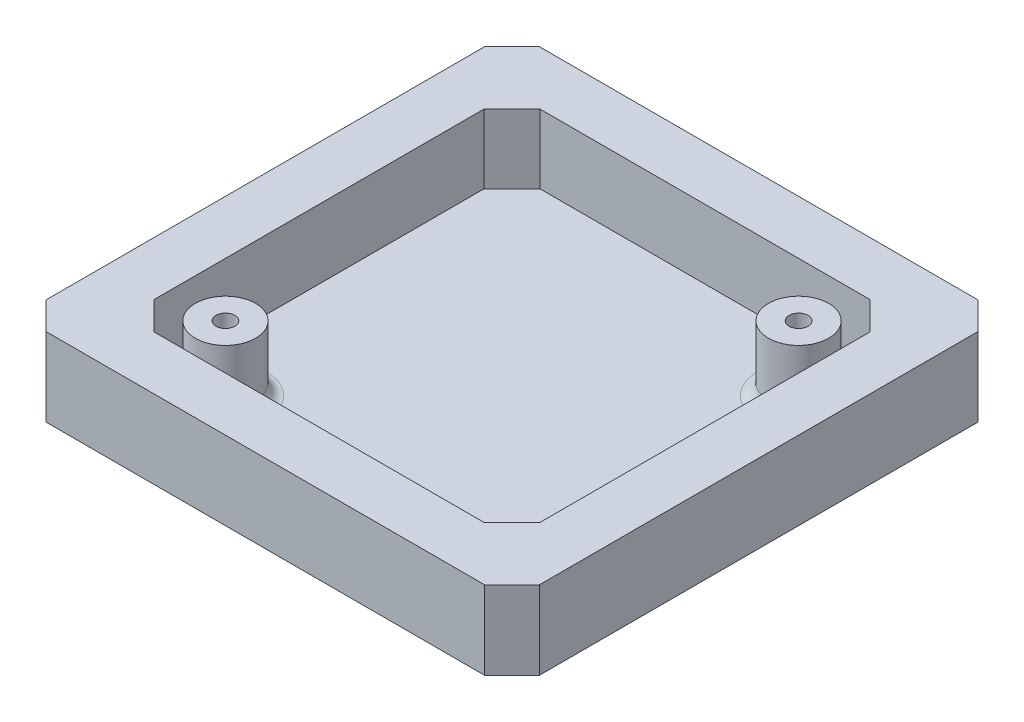
ISO-10303-21;
HEADER;
FILE_DESCRIPTION(('STEP AP214'),'2;1');
FILE_NAME('part.step','',(''),(''),'','','');
FILE_SCHEMA(('AUTOMOTIVE_DESIGN { 1 0 10303 214 1 1 1 1 }'));
ENDSEC;
DATA;
#1=APPLICATION_CONTEXT('core data for automotive mechanical design processes');
#2=APPLICATION_PROTOCOL_DEFINITION('international standard','automotive_design',2000,#1);
#3=PRODUCT_CONTEXT('',#1,'mechanical');
#4=PRODUCT('Part','Part','',(#3));
#5=PRODUCT_RELATED_PRODUCT_CATEGORY('part','',(#4));
#6=PRODUCT_DEFINITION_FORMATION('','',#4);
#7=PRODUCT_DEFINITION_CONTEXT('part definition',#1,'design');
#8=PRODUCT_DEFINITION('design','',#6,#7);
#9=PRODUCT_DEFINITION_SHAPE('','',#8);
#10=(LENGTH_UNIT() NAMED_UNIT(*) SI_UNIT(.MILLI.,.METRE.));
#11=(NAMED_UNIT(*) PLANE_ANGLE_UNIT() SI_UNIT($,.RADIAN.));
#12=(NAMED_UNIT(*) SI_UNIT($,.STERADIAN.) SOLID_ANGLE_UNIT());
#13=UNCERTAINTY_MEASURE_WITH_UNIT(LENGTH_MEASURE(1.E-05),#10,'distance_accuracy_value','');
#14=(GEOMETRIC_REPRESENTATION_CONTEXT(3) GLOBAL_UNCERTAINTY_ASSIGNED_CONTEXT((#13)) GLOBAL_UNIT_ASSIGNED_CONTEXT((#10,
#11,#12)) REPRESENTATION_CONTEXT('',''));
#15=CARTESIAN_POINT('',(0.,0.,0.));
#16=DIRECTION('',(0.,0.,1.));
#17=DIRECTION('',(1.,0.,0.));
#18=AXIS2_PLACEMENT_3D('',#15,#16,#17);
#19=CARTESIAN_POINT('',(0.,14.3,0.));
#20=DIRECTION('',(0.,-1.,0.));
#21=DIRECTION('',(0.,0.,-1.));
#22=AXIS2_PLACEMENT_3D('',#19,#20,#21);
#23=PLANE('',#22);
#24=DIRECTION('',(0.,0.,1.));
#25=VECTOR('',#24,1.);
#26=CARTESIAN_POINT('',(0.,14.3,0.));
#27=LINE('',#26,#25);
#28=CARTESIAN_POINT('',(0.,14.3,-84.9999999999999));
#29=VERTEX_POINT('',#28);
#30=CARTESIAN_POINT('',(0.,14.3,-5.00000000000003));
#31=VERTEX_POINT('',#30);
#32=EDGE_CURVE('E290',#29,#31,#27,.T.);
#33=ORIENTED_EDGE('',*,*,#32,.T.);
#34=DIRECTION('',(-0.707106781186547,0.,-0.707106781186548));
#35=VECTOR('',#34,1.);
#36=CARTESIAN_POINT('',(5.00000000000002,14.3,0.));
#37=LINE('',#36,#35);
#38=CARTESIAN_POINT('',(5.00000000000001,14.3,0.));
#39=VERTEX_POINT('',#38);
#40=EDGE_CURVE('E354',#31,#39,#37,.F.);
#41=ORIENTED_EDGE('',*,*,#40,.T.);
#42=DIRECTION('',(1.,0.,0.));
#43=VECTOR('',#42,1.);
#44=CARTESIAN_POINT('',(0.,14.3,0.));
#45=LINE('',#44,#43);
#46=CARTESIAN_POINT('',(84.9999999999999,14.3,0.));
#47=VERTEX_POINT('',#46);
#48=EDGE_CURVE('E294',#39,#47,#45,.T.);
#49=ORIENTED_EDGE('',*,*,#48,.T.);
#50=DIRECTION('',(-0.70710678118655,0.,0.707106781186545));
#51=VECTOR('',#50,1.);
#52=CARTESIAN_POINT('',(90.,14.3,-5.00000000000002));
#53=LINE('',#52,#51);
#54=CARTESIAN_POINT('',(90.,14.3,-5.00000000000001));
#55=VERTEX_POINT('',#54);
#56=EDGE_CURVE('E345',#47,#55,#53,.F.);
#57=ORIENTED_EDGE('',*,*,#56,.T.);
#58=DIRECTION('',(0.,0.,-1.));
#59=VECTOR('',#58,1.);
#60=CARTESIAN_POINT('',(90.,14.3,0.));
#61=LINE('',#60,#59);
#62=CARTESIAN_POINT('',(90.,14.3,-84.9999999999999));
#63=VERTEX_POINT('',#62);
#64=EDGE_CURVE('E299',#55,#63,#61,.T.);
#65=ORIENTED_EDGE('',*,*,#64,.T.);
#66=DIRECTION('',(0.707106781186548,0.,0.707106781186548));
#67=VECTOR('',#66,1.);
#68=CARTESIAN_POINT('',(85.,14.3,-90.));
#69=LINE('',#68,#67);
#70=CARTESIAN_POINT('',(84.9999999999999,14.3,-90.));
#71=VERTEX_POINT('',#70);
#72=EDGE_CURVE('E348',#63,#71,#69,.F.);
#73=ORIENTED_EDGE('',*,*,#72,.T.);
#74=DIRECTION('',(-1.,0.,0.));
#75=VECTOR('',#74,1.);
#76=CARTESIAN_POINT('',(0.,14.3,-90.));
#77=LINE('',#76,#75);
#78=CARTESIAN_POINT('',(5.00000000000001,14.3,-90.));
#79=VERTEX_POINT('',#78);
#80=EDGE_CURVE('E303',#71,#79,#77,.T.);
#81=ORIENTED_EDGE('',*,*,#80,.T.);
#82=DIRECTION('',(0.707106781186546,0.,-0.707106781186549));
#83=VECTOR('',#82,1.);
#84=CARTESIAN_POINT('',(0.,14.3,-85.));
#85=LINE('',#84,#83);
#86=EDGE_CURVE('E351',#79,#29,#85,.F.);
#87=ORIENTED_EDGE('',*,*,#86,.T.);
#88=EDGE_LOOP('',(#33,#41,#49,#57,#65,#73,#81,#87));
#89=FACE_BOUND('',#88,.T.);
#90=DIRECTION('',(1.,0.,0.));
#91=VECTOR('',#90,1.);
#92=CARTESIAN_POINT('',(0.,14.3,-9.80000000000006));
#93=LINE('',#92,#91);
#94=CARTESIAN_POINT('',(14.9171572875255,14.3,-9.80000000000007));
#95=VERTEX_POINT('',#94);
#96=CARTESIAN_POINT('',(75.0828427124747,14.3,-9.80000000000006));
#97=VERTEX_POINT('',#96);
#98=EDGE_CURVE('E166',#95,#97,#93,.T.);
#99=ORIENTED_EDGE('',*,*,#98,.F.);
#100=DIRECTION('',(0.707106781186551,0.,0.707106781186544));
#101=VECTOR('',#100,1.);
#102=CARTESIAN_POINT('',(12.3585786437627,14.3,-12.3585786437628));
#103=LINE('',#102,#101);
#104=CARTESIAN_POINT('',(9.80000000000007,14.3,-14.9171572875254));
#105=VERTEX_POINT('',#104);
#106=EDGE_CURVE('E210',#105,#95,#103,.T.);
#107=ORIENTED_EDGE('',*,*,#106,.F.);
#108=DIRECTION('',(0.,0.,1.));
#109=VECTOR('',#108,1.);
#110=CARTESIAN_POINT('',(9.80000000000006,14.3,0.));
#111=LINE('',#110,#109);
#112=CARTESIAN_POINT('',(9.80000000000007,14.3,-75.0828427124746));
#113=VERTEX_POINT('',#112);
#114=EDGE_CURVE('E207',#113,#105,#111,.T.);
#115=ORIENTED_EDGE('',*,*,#114,.F.);
#116=DIRECTION('',(-0.707106781186545,0.,0.70710678118655));
#117=VECTOR('',#116,1.);
#118=CARTESIAN_POINT('',(-32.6414213562372,14.3,-32.641421356237));
#119=LINE('',#118,#117);
#120=CARTESIAN_POINT('',(14.9171572875255,14.3,-80.2));
#121=VERTEX_POINT('',#120);
#122=EDGE_CURVE('E204',#121,#113,#119,.T.);
#123=ORIENTED_EDGE('',*,*,#122,.F.);
#124=DIRECTION('',(-1.,0.,0.));
#125=VECTOR('',#124,1.);
#126=CARTESIAN_POINT('',(0.,14.3,-80.2));
#127=LINE('',#126,#125);
#128=CARTESIAN_POINT('',(75.0828427124746,14.3,-80.2));
#129=VERTEX_POINT('',#128);
#130=EDGE_CURVE('E201',#129,#121,#127,.T.);
#131=ORIENTED_EDGE('',*,*,#130,.F.);
#132=DIRECTION('',(-0.70710678118655,0.,-0.707106781186545));
#133=VECTOR('',#132,1.);
#134=CARTESIAN_POINT('',(77.641421356237,14.3,-77.6414213562376));
#135=LINE('',#134,#133);
#136=CARTESIAN_POINT('',(80.2,14.3,-75.0828427124746));
#137=VERTEX_POINT('',#136);
#138=EDGE_CURVE('E196',#137,#129,#135,.T.);
#139=ORIENTED_EDGE('',*,*,#138,.F.);
#140=DIRECTION('',(0.,0.,-1.));
#141=VECTOR('',#140,1.);
#142=CARTESIAN_POINT('',(80.2,14.3,0.));
#143=LINE('',#142,#141);
#144=CARTESIAN_POINT('',(80.2,14.3,-14.9171572875255));
#145=VERTEX_POINT('',#144);
#146=EDGE_CURVE('E192',#145,#137,#143,.T.);
#147=ORIENTED_EDGE('',*,*,#146,.F.);
#148=DIRECTION('',(0.707106781186543,0.,-0.707106781186552));
#149=VECTOR('',#148,1.);
#150=CARTESIAN_POINT('',(32.6414213562377,14.3,32.6414213562374));
#151=LINE('',#150,#149);
#152=EDGE_CURVE('E178',#97,#145,#151,.T.);
#153=ORIENTED_EDGE('',*,*,#152,.F.);
#154=EDGE_LOOP('',(#99,#107,#115,#123,#131,#139,#147,#153));
#155=FACE_BOUND('',#154,.T.);
#156=ADVANCED_FACE('F46',(#89,#155),#23,.F.);
#157=CARTESIAN_POINT('',(71.1360389664451,0.,-71.1360389664451));
#158=DIRECTION('',(0.,1.,0.));
#159=DIRECTION('',(0.,0.,1.));
#160=AXIS2_PLACEMENT_3D('',#157,#158,#159);
#161=CYLINDRICAL_SURFACE('',#160,1.725);
#162=CARTESIAN_POINT('',(71.1360389664451,13.5,-71.1360389664451));
#163=DIRECTION('',(0.,-1.,0.));
#164=DIRECTION('',(0.,0.,-1.));
#165=AXIS2_PLACEMENT_3D('',#162,#163,#164);
#166=CIRCLE('',#165,1.725);
#167=CARTESIAN_POINT('',(71.1360389664451,13.5,-72.8610389664451));
#168=VERTEX_POINT('',#167);
#169=EDGE_CURVE('E285',#168,#168,#166,.T.);
#170=ORIENTED_EDGE('',*,*,#169,.F.);
#171=EDGE_LOOP('',(#170));
#172=FACE_BOUND('',#171,.T.);
#173=CARTESIAN_POINT('',(71.1360389664451,4.,-71.1360389664451));
#174=DIRECTION('',(0.,-1.,0.));
#175=DIRECTION('',(0.,0.,-1.));
#176=AXIS2_PLACEMENT_3D('',#173,#174,#175);
#177=CIRCLE('',#176,1.725);
#178=CARTESIAN_POINT('',(71.1360389664451,4.,-72.8610389664451));
#179=VERTEX_POINT('',#178);
#180=EDGE_CURVE('E50',#179,#179,#177,.F.);
#181=ORIENTED_EDGE('',*,*,#180,.F.);
#182=EDGE_LOOP('',(#181));
#183=FACE_BOUND('',#182,.T.);
#184=ADVANCED_FACE('F390',(#172,#183),#161,.F.);
#185=CARTESIAN_POINT('',(18.863961033555,0.,-18.863961033555));
#186=DIRECTION('',(0.,1.,0.));
#187=DIRECTION('',(0.,0.,1.));
#188=AXIS2_PLACEMENT_3D('',#185,#186,#187);
#189=CYLINDRICAL_SURFACE('',#188,1.725);
#190=CARTESIAN_POINT('',(18.863961033555,13.5,-18.863961033555));
#191=DIRECTION('',(0.,-1.,0.));
#192=DIRECTION('',(0.,0.,-1.));
#193=AXIS2_PLACEMENT_3D('',#190,#191,#192);
#194=CIRCLE('',#193,1.725);
#195=CARTESIAN_POINT('',(18.863961033555,13.5,-20.588961033555));
#196=VERTEX_POINT('',#195);
#197=EDGE_CURVE('E273',#196,#196,#194,.T.);
#198=ORIENTED_EDGE('',*,*,#197,.F.);
#199=EDGE_LOOP('',(#198));
#200=FACE_BOUND('',#199,.T.);
#201=CARTESIAN_POINT('',(18.863961033555,4.,-18.863961033555));
#202=DIRECTION('',(0.,-1.,0.));
#203=DIRECTION('',(0.,0.,-1.));
#204=AXIS2_PLACEMENT_3D('',#201,#202,#203);
#205=CIRCLE('',#204,1.725);
#206=CARTESIAN_POINT('',(18.863961033555,4.,-20.588961033555));
#207=VERTEX_POINT('',#206);
#208=EDGE_CURVE('E261',#207,#207,#205,.F.);
#209=ORIENTED_EDGE('',*,*,#208,.F.);
#210=EDGE_LOOP('',(#209));
#211=FACE_BOUND('',#210,.T.);
#212=ADVANCED_FACE('F392',(#200,#211),#189,.F.);
#213=CARTESIAN_POINT('',(0.,1.7,0.));
#214=DIRECTION('',(0.,-1.,0.));
#215=DIRECTION('',(0.,0.,-1.));
#216=AXIS2_PLACEMENT_3D('',#213,#214,#215);
#217=PLANE('',#216);
#218=CARTESIAN_POINT('',(18.863961033555,1.7,-18.863961033555));
#219=DIRECTION('',(0.,-1.,0.));
#220=DIRECTION('',(0.,0.,-1.));
#221=AXIS2_PLACEMENT_3D('',#218,#219,#220);
#222=CIRCLE('',#221,7.5);
#223=CARTESIAN_POINT('',(18.863961033555,1.7,-26.363961033555));
#224=VERTEX_POINT('',#223);
#225=EDGE_CURVE('E56',#224,#224,#222,.T.);
#226=ORIENTED_EDGE('',*,*,#225,.T.);
#227=EDGE_LOOP('',(#226));
#228=FACE_BOUND('',#227,.T.);
#229=CARTESIAN_POINT('',(71.1360389664451,1.7,-71.1360389664451));
#230=DIRECTION('',(0.,-1.,0.));
#231=DIRECTION('',(0.,0.,-1.));
#232=AXIS2_PLACEMENT_3D('',#229,#230,#231);
#233=CIRCLE('',#232,7.5);
#234=CARTESIAN_POINT('',(71.1360389664451,1.7,-78.6360389664451));
#235=VERTEX_POINT('',#234);
#236=EDGE_CURVE('E374',#235,#235,#233,.T.);
#237=ORIENTED_EDGE('',*,*,#236,.T.);
#238=EDGE_LOOP('',(#237));
#239=FACE_BOUND('',#238,.T.);
#240=DIRECTION('',(1.,0.,0.));
#241=VECTOR('',#240,1.);
#242=CARTESIAN_POINT('',(0.,1.7,-9.80000000000006));
#243=LINE('',#242,#241);
#244=CARTESIAN_POINT('',(14.9171572875255,1.7,-9.80000000000007));
#245=VERTEX_POINT('',#244);
#246=CARTESIAN_POINT('',(75.0828427124747,1.7,-9.80000000000006));
#247=VERTEX_POINT('',#246);
#248=EDGE_CURVE('E213',#245,#247,#243,.T.);
#249=ORIENTED_EDGE('',*,*,#248,.T.);
#250=DIRECTION('',(0.707106781186543,0.,-0.707106781186552));
#251=VECTOR('',#250,1.);
#252=CARTESIAN_POINT('',(32.6414213562377,1.7,32.6414213562374));
#253=LINE('',#252,#251);
#254=CARTESIAN_POINT('',(80.2,1.7,-14.9171572875255));
#255=VERTEX_POINT('',#254);
#256=EDGE_CURVE('E185',#247,#255,#253,.T.);
#257=ORIENTED_EDGE('',*,*,#256,.T.);
#258=DIRECTION('',(0.,0.,-1.));
#259=VECTOR('',#258,1.);
#260=CARTESIAN_POINT('',(80.2,1.7,0.));
#261=LINE('',#260,#259);
#262=CARTESIAN_POINT('',(80.2,1.7,-75.0828427124746));
#263=VERTEX_POINT('',#262);
#264=EDGE_CURVE('E218',#255,#263,#261,.T.);
#265=ORIENTED_EDGE('',*,*,#264,.T.);
#266=DIRECTION('',(-0.70710678118655,0.,-0.707106781186545));
#267=VECTOR('',#266,1.);
#268=CARTESIAN_POINT('',(77.641421356237,1.7,-77.6414213562376));
#269=LINE('',#268,#267);
#270=CARTESIAN_POINT('',(75.0828427124746,1.7,-80.2));
#271=VERTEX_POINT('',#270);
#272=EDGE_CURVE('E221',#263,#271,#269,.T.);
#273=ORIENTED_EDGE('',*,*,#272,.T.);
#274=DIRECTION('',(-1.,0.,0.));
#275=VECTOR('',#274,1.);
#276=CARTESIAN_POINT('',(0.,1.7,-80.2));
#277=LINE('',#276,#275);
#278=CARTESIAN_POINT('',(14.9171572875255,1.7,-80.2));
#279=VERTEX_POINT('',#278);
#280=EDGE_CURVE('E224',#271,#279,#277,.T.);
#281=ORIENTED_EDGE('',*,*,#280,.T.);
#282=DIRECTION('',(-0.707106781186545,0.,0.70710678118655));
#283=VECTOR('',#282,1.);
#284=CARTESIAN_POINT('',(-32.6414213562372,1.7,-32.641421356237));
#285=LINE('',#284,#283);
#286=CARTESIAN_POINT('',(9.80000000000007,1.7,-75.0828427124746));
#287=VERTEX_POINT('',#286);
#288=EDGE_CURVE('E227',#279,#287,#285,.T.);
#289=ORIENTED_EDGE('',*,*,#288,.T.);
#290=DIRECTION('',(0.,0.,1.));
#291=VECTOR('',#290,1.);
#292=CARTESIAN_POINT('',(9.80000000000006,1.7,0.));
#293=LINE('',#292,#291);
#294=CARTESIAN_POINT('',(9.80000000000006,1.7,-14.9171572875254));
#295=VERTEX_POINT('',#294);
#296=EDGE_CURVE('E230',#287,#295,#293,.T.);
#297=ORIENTED_EDGE('',*,*,#296,.T.);
#298=DIRECTION('',(0.707106781186551,0.,0.707106781186544));
#299=VECTOR('',#298,1.);
#300=CARTESIAN_POINT('',(12.3585786437627,1.7,-12.3585786437628));
#301=LINE('',#300,#299);
#302=EDGE_CURVE('E179',#295,#245,#301,.T.);
#303=ORIENTED_EDGE('',*,*,#302,.T.);
#304=EDGE_LOOP('',(#249,#257,#265,#273,#281,#289,#297,#303));
#305=FACE_BOUND('',#304,.T.);
#306=ADVANCED_FACE('F399',(#228,#239,#305),#217,.F.);
#307=CARTESIAN_POINT('',(0.,14.3,0.));
#308=DIRECTION('',(1.,0.,0.));
#309=DIRECTION('',(0.,0.,-1.));
#310=AXIS2_PLACEMENT_3D('',#307,#308,#309);
#311=PLANE('',#310);
#312=DIRECTION('',(0.,0.,1.));
#313=VECTOR('',#312,1.);
#314=CARTESIAN_POINT('',(0.,0.,0.));
#315=LINE('',#314,#313);
#316=CARTESIAN_POINT('',(0.,0.,-84.9999999999999));
#317=VERTEX_POINT('',#316);
#318=CARTESIAN_POINT('',(0.,0.,-5.00000000000003));
#319=VERTEX_POINT('',#318);
#320=EDGE_CURVE('E289',#317,#319,#315,.T.);
#321=ORIENTED_EDGE('',*,*,#320,.T.);
#322=DIRECTION('',(0.,1.,0.));
#323=VECTOR('',#322,1.);
#324=CARTESIAN_POINT('',(0.,14.3,-5.00000000000003));
#325=LINE('',#324,#323);
#326=EDGE_CURVE('E342',#319,#31,#325,.T.);
#327=ORIENTED_EDGE('',*,*,#326,.T.);
#328=ORIENTED_EDGE('',*,*,#32,.F.);
#329=DIRECTION('',(0.,-1.,0.));
#330=VECTOR('',#329,1.);
#331=CARTESIAN_POINT('',(0.,14.3,-85.));
#332=LINE('',#331,#330);
#333=EDGE_CURVE('E338',#29,#317,#332,.T.);
#334=ORIENTED_EDGE('',*,*,#333,.T.);
#335=EDGE_LOOP('',(#321,#327,#328,#334));
#336=FACE_BOUND('',#335,.T.);
#337=ADVANCED_FACE('F408',(#336),#311,.F.);
#338=CARTESIAN_POINT('',(0.,14.3,0.));
#339=DIRECTION('',(0.,0.,-1.));
#340=DIRECTION('',(-1.,0.,0.));
#341=AXIS2_PLACEMENT_3D('',#338,#339,#340);
#342=PLANE('',#341);
#343=ORIENTED_EDGE('',*,*,#48,.F.);
#344=DIRECTION('',(0.,-1.,0.));
#345=VECTOR('',#344,1.);
#346=CARTESIAN_POINT('',(5.00000000000002,14.3,0.));
#347=LINE('',#346,#345);
#348=CARTESIAN_POINT('',(5.00000000000001,0.,0.));
#349=VERTEX_POINT('',#348);
#350=EDGE_CURVE('E322',#39,#349,#347,.T.);
#351=ORIENTED_EDGE('',*,*,#350,.T.);
#352=DIRECTION('',(1.,0.,0.));
#353=VECTOR('',#352,1.);
#354=CARTESIAN_POINT('',(0.,0.,0.));
#355=LINE('',#354,#353);
#356=CARTESIAN_POINT('',(84.9999999999999,0.,0.));
#357=VERTEX_POINT('',#356);
#358=EDGE_CURVE('E310',#349,#357,#355,.T.);
#359=ORIENTED_EDGE('',*,*,#358,.T.);
#360=DIRECTION('',(0.,1.,0.));
#361=VECTOR('',#360,1.);
#362=CARTESIAN_POINT('',(85.,14.3,0.));
#363=LINE('',#362,#361);
#364=EDGE_CURVE('E306',#357,#47,#363,.T.);
#365=ORIENTED_EDGE('',*,*,#364,.T.);
#366=EDGE_LOOP('',(#343,#351,#359,#365));
#367=FACE_BOUND('',#366,.T.);
#368=ADVANCED_FACE('F422',(#367),#342,.F.);
#369=CARTESIAN_POINT('',(90.,14.3,0.));
#370=DIRECTION('',(-1.,0.,0.));
#371=DIRECTION('',(0.,0.,1.));
#372=AXIS2_PLACEMENT_3D('',#369,#370,#371);
#373=PLANE('',#372);
#374=DIRECTION('',(0.,0.,-1.));
#375=VECTOR('',#374,1.);
#376=CARTESIAN_POINT('',(90.,0.,0.));
#377=LINE('',#376,#375);
#378=CARTESIAN_POINT('',(90.,0.,-5.00000000000001));
#379=VERTEX_POINT('',#378);
#380=CARTESIAN_POINT('',(90.,0.,-84.9999999999999));
#381=VERTEX_POINT('',#380);
#382=EDGE_CURVE('E314',#379,#381,#377,.T.);
#383=ORIENTED_EDGE('',*,*,#382,.T.);
#384=DIRECTION('',(0.,1.,0.));
#385=VECTOR('',#384,1.);
#386=CARTESIAN_POINT('',(90.,14.3,-85.));
#387=LINE('',#386,#385);
#388=EDGE_CURVE('E367',#381,#63,#387,.T.);
#389=ORIENTED_EDGE('',*,*,#388,.T.);
#390=ORIENTED_EDGE('',*,*,#64,.F.);
#391=DIRECTION('',(0.,-1.,0.));
#392=VECTOR('',#391,1.);
#393=CARTESIAN_POINT('',(90.,14.3,-5.00000000000002));
#394=LINE('',#393,#392);
#395=EDGE_CURVE('E363',#55,#379,#394,.T.);
#396=ORIENTED_EDGE('',*,*,#395,.T.);
#397=EDGE_LOOP('',(#383,#389,#390,#396));
#398=FACE_BOUND('',#397,.T.);
#399=ADVANCED_FACE('F419',(#398),#373,.F.);
#400=CARTESIAN_POINT('',(0.,14.3,-90.));
#401=DIRECTION('',(0.,0.,1.));
#402=DIRECTION('',(1.,0.,0.));
#403=AXIS2_PLACEMENT_3D('',#400,#401,#402);
#404=PLANE('',#403);
#405=DIRECTION('',(-1.,0.,0.));
#406=VECTOR('',#405,1.);
#407=CARTESIAN_POINT('',(0.,0.,-90.));
#408=LINE('',#407,#406);
#409=CARTESIAN_POINT('',(84.9999999999999,0.,-90.));
#410=VERTEX_POINT('',#409);
#411=CARTESIAN_POINT('',(5.00000000000001,0.,-90.));
#412=VERTEX_POINT('',#411);
#413=EDGE_CURVE('E295',#410,#412,#408,.T.);
#414=ORIENTED_EDGE('',*,*,#413,.T.);
#415=DIRECTION('',(0.,1.,0.));
#416=VECTOR('',#415,1.);
#417=CARTESIAN_POINT('',(5.00000000000002,14.3,-90.));
#418=LINE('',#417,#416);
#419=EDGE_CURVE('E72',#412,#79,#418,.T.);
#420=ORIENTED_EDGE('',*,*,#419,.T.);
#421=ORIENTED_EDGE('',*,*,#80,.F.);
#422=DIRECTION('',(0.,-1.,0.));
#423=VECTOR('',#422,1.);
#424=CARTESIAN_POINT('',(85.,14.3,-90.));
#425=LINE('',#424,#423);
#426=EDGE_CURVE('E357',#71,#410,#425,.T.);
#427=ORIENTED_EDGE('',*,*,#426,.T.);
#428=EDGE_LOOP('',(#414,#420,#421,#427));
#429=FACE_BOUND('',#428,.T.);
#430=ADVANCED_FACE('F415',(#429),#404,.F.);
#431=CARTESIAN_POINT('',(0.,0.,0.));
#432=DIRECTION('',(0.,-1.,0.));
#433=DIRECTION('',(0.,0.,-1.));
#434=AXIS2_PLACEMENT_3D('',#431,#432,#433);
#435=PLANE('',#434);
#436=CARTESIAN_POINT('',(18.863961033555,0.,-18.863961033555));
#437=DIRECTION('',(0.,-1.,0.));
#438=DIRECTION('',(0.,0.,-1.));
#439=AXIS2_PLACEMENT_3D('',#436,#437,#438);
#440=CIRCLE('',#439,3.25);
#441=CARTESIAN_POINT('',(18.863961033555,0.,-22.113961033555));
#442=VERTEX_POINT('',#441);
#443=EDGE_CURVE('E262',#442,#442,#440,.T.);
#444=ORIENTED_EDGE('',*,*,#443,.F.);
#445=EDGE_LOOP('',(#444));
#446=FACE_BOUND('',#445,.T.);
#447=CARTESIAN_POINT('',(71.1360389664451,0.,-71.1360389664451));
#448=DIRECTION('',(0.,-1.,0.));
#449=DIRECTION('',(0.,0.,-1.));
#450=AXIS2_PLACEMENT_3D('',#447,#448,#449);
#451=CIRCLE('',#450,3.25000000000001);
#452=CARTESIAN_POINT('',(71.1360389664451,0.,-74.3860389664451));
#453=VERTEX_POINT('',#452);
#454=EDGE_CURVE('E266',#453,#453,#451,.T.);
#455=ORIENTED_EDGE('',*,*,#454,.F.);
#456=EDGE_LOOP('',(#455));
#457=FACE_BOUND('',#456,.T.);
#458=ORIENTED_EDGE('',*,*,#358,.F.);
#459=DIRECTION('',(0.707106781186547,0.,0.707106781186548));
#460=VECTOR('',#459,1.);
#461=CARTESIAN_POINT('',(2.50000000000001,0.,-2.50000000000001));
#462=LINE('',#461,#460);
#463=EDGE_CURVE('E335',#349,#319,#462,.F.);
#464=ORIENTED_EDGE('',*,*,#463,.T.);
#465=ORIENTED_EDGE('',*,*,#320,.F.);
#466=DIRECTION('',(-0.707106781186546,0.,0.707106781186549));
#467=VECTOR('',#466,1.);
#468=CARTESIAN_POINT('',(-42.5,0.,-42.4999999999998));
#469=LINE('',#468,#467);
#470=EDGE_CURVE('E332',#317,#412,#469,.F.);
#471=ORIENTED_EDGE('',*,*,#470,.T.);
#472=ORIENTED_EDGE('',*,*,#413,.F.);
#473=DIRECTION('',(-0.707106781186548,0.,-0.707106781186548));
#474=VECTOR('',#473,1.);
#475=CARTESIAN_POINT('',(87.5,0.,-87.5));
#476=LINE('',#475,#474);
#477=EDGE_CURVE('E329',#410,#381,#476,.F.);
#478=ORIENTED_EDGE('',*,*,#477,.T.);
#479=ORIENTED_EDGE('',*,*,#382,.F.);
#480=DIRECTION('',(0.70710678118655,0.,-0.707106781186545));
#481=VECTOR('',#480,1.);
#482=CARTESIAN_POINT('',(42.4999999999997,0.,42.5));
#483=LINE('',#482,#481);
#484=EDGE_CURVE('E326',#379,#357,#483,.F.);
#485=ORIENTED_EDGE('',*,*,#484,.T.);
#486=EDGE_LOOP('',(#458,#464,#465,#471,#472,#478,#479,#485));
#487=FACE_BOUND('',#486,.T.);
#488=ADVANCED_FACE('F411',(#446,#457,#487),#435,.T.);
#489=CARTESIAN_POINT('',(5.00000000000002,14.3,0.));
#490=DIRECTION('',(0.707106781186548,0.,-0.707106781186547));
#491=DIRECTION('',(0.,-1.,0.));
#492=AXIS2_PLACEMENT_3D('',#489,#490,#491);
#493=PLANE('',#492);
#494=ORIENTED_EDGE('',*,*,#40,.F.);
#495=ORIENTED_EDGE('',*,*,#326,.F.);
#496=ORIENTED_EDGE('',*,*,#463,.F.);
#497=ORIENTED_EDGE('',*,*,#350,.F.);
#498=EDGE_LOOP('',(#494,#495,#496,#497));
#499=FACE_BOUND('',#498,.T.);
#500=ADVANCED_FACE('F414',(#499),#493,.F.);
#501=CARTESIAN_POINT('',(0.,14.3,-85.));
#502=DIRECTION('',(0.707106781186549,0.,0.707106781186546));
#503=DIRECTION('',(0.,-1.,0.));
#504=AXIS2_PLACEMENT_3D('',#501,#502,#503);
#505=PLANE('',#504);
#506=ORIENTED_EDGE('',*,*,#86,.F.);
#507=ORIENTED_EDGE('',*,*,#419,.F.);
#508=ORIENTED_EDGE('',*,*,#470,.F.);
#509=ORIENTED_EDGE('',*,*,#333,.F.);
#510=EDGE_LOOP('',(#506,#507,#508,#509));
#511=FACE_BOUND('',#510,.T.);
#512=ADVANCED_FACE('F436',(#511),#505,.F.);
#513=CARTESIAN_POINT('',(85.,14.3,-90.));
#514=DIRECTION('',(-0.707106781186547,0.,0.707106781186547));
#515=DIRECTION('',(0.,-1.,0.));
#516=AXIS2_PLACEMENT_3D('',#513,#514,#515);
#517=PLANE('',#516);
#518=ORIENTED_EDGE('',*,*,#72,.F.);
#519=ORIENTED_EDGE('',*,*,#388,.F.);
#520=ORIENTED_EDGE('',*,*,#477,.F.);
#521=ORIENTED_EDGE('',*,*,#426,.F.);
#522=EDGE_LOOP('',(#518,#519,#520,#521));
#523=FACE_BOUND('',#522,.T.);
#524=ADVANCED_FACE('F443',(#523),#517,.F.);
#525=CARTESIAN_POINT('',(90.,14.3,-5.00000000000002));
#526=DIRECTION('',(-0.707106781186545,0.,-0.70710678118655));
#527=DIRECTION('',(0.,-1.,0.));
#528=AXIS2_PLACEMENT_3D('',#525,#526,#527);
#529=PLANE('',#528);
#530=ORIENTED_EDGE('',*,*,#56,.F.);
#531=ORIENTED_EDGE('',*,*,#364,.F.);
#532=ORIENTED_EDGE('',*,*,#484,.F.);
#533=ORIENTED_EDGE('',*,*,#395,.F.);
#534=EDGE_LOOP('',(#530,#531,#532,#533));
#535=FACE_BOUND('',#534,.T.);
#536=ADVANCED_FACE('F450',(#535),#529,.F.);
#537=CARTESIAN_POINT('',(71.1360389664451,29.8563491861041,-71.1360389664451));
#538=DIRECTION('',(0.,-1.,0.));
#539=DIRECTION('',(0.,0.,-1.));
#540=AXIS2_PLACEMENT_3D('',#537,#538,#539);
#541=CYLINDRICAL_SURFACE('',#540,5.5);
#542=CARTESIAN_POINT('',(71.1360389664451,3.7,-71.1360389664451));
#543=DIRECTION('',(0.,-1.,0.));
#544=DIRECTION('',(0.,0.,-1.));
#545=AXIS2_PLACEMENT_3D('',#542,#543,#544);
#546=CIRCLE('',#545,5.5);
#547=CARTESIAN_POINT('',(71.1360389664451,3.7,-76.6360389664451));
#548=VERTEX_POINT('',#547);
#549=EDGE_CURVE('E12',#548,#548,#546,.F.);
#550=ORIENTED_EDGE('',*,*,#549,.T.);
#551=EDGE_LOOP('',(#550));
#552=FACE_BOUND('',#551,.T.);
#553=CARTESIAN_POINT('',(71.1360389664451,13.5,-71.1360389664451));
#554=DIRECTION('',(0.,-1.,0.));
#555=DIRECTION('',(0.,0.,-1.));
#556=AXIS2_PLACEMENT_3D('',#553,#554,#555);
#557=CIRCLE('',#556,5.5);
#558=CARTESIAN_POINT('',(71.1360389664451,13.5,-76.6360389664451));
#559=VERTEX_POINT('',#558);
#560=EDGE_CURVE('E281',#559,#559,#557,.T.);
#561=ORIENTED_EDGE('',*,*,#560,.T.);
#562=EDGE_LOOP('',(#561));
#563=FACE_BOUND('',#562,.T.);
#564=ADVANCED_FACE('F455',(#552,#563),#541,.T.);
#565=CARTESIAN_POINT('',(0.,13.5,0.));
#566=DIRECTION('',(0.,-1.,0.));
#567=DIRECTION('',(0.,0.,-1.));
#568=AXIS2_PLACEMENT_3D('',#565,#566,#567);
#569=PLANE('',#568);
#570=ORIENTED_EDGE('',*,*,#169,.T.);
#571=EDGE_LOOP('',(#570));
#572=FACE_BOUND('',#571,.T.);
#573=ORIENTED_EDGE('',*,*,#560,.F.);
#574=EDGE_LOOP('',(#573));
#575=FACE_BOUND('',#574,.T.);
#576=ADVANCED_FACE('F476',(#572,#575),#569,.F.);
#577=CARTESIAN_POINT('',(18.863961033555,29.8563491861041,-18.863961033555));
#578=DIRECTION('',(0.,-1.,0.));
#579=DIRECTION('',(0.,0.,-1.));
#580=AXIS2_PLACEMENT_3D('',#577,#578,#579);
#581=CYLINDRICAL_SURFACE('',#580,5.5);
#582=CARTESIAN_POINT('',(18.863961033555,3.7,-18.863961033555));
#583=DIRECTION('',(0.,-1.,0.));
#584=DIRECTION('',(0.,0.,-1.));
#585=AXIS2_PLACEMENT_3D('',#582,#583,#584);
#586=CIRCLE('',#585,5.5);
#587=CARTESIAN_POINT('',(18.863961033555,3.7,-24.363961033555));
#588=VERTEX_POINT('',#587);
#589=EDGE_CURVE('E370',#588,#588,#586,.F.);
#590=ORIENTED_EDGE('',*,*,#589,.T.);
#591=EDGE_LOOP('',(#590));
#592=FACE_BOUND('',#591,.T.);
#593=CARTESIAN_POINT('',(18.863961033555,13.5,-18.863961033555));
#594=DIRECTION('',(0.,-1.,0.));
#595=DIRECTION('',(0.,0.,-1.));
#596=AXIS2_PLACEMENT_3D('',#593,#594,#595);
#597=CIRCLE('',#596,5.5);
#598=CARTESIAN_POINT('',(18.863961033555,13.5,-24.363961033555));
#599=VERTEX_POINT('',#598);
#600=EDGE_CURVE('E277',#599,#599,#597,.T.);
#601=ORIENTED_EDGE('',*,*,#600,.T.);
#602=EDGE_LOOP('',(#601));
#603=FACE_BOUND('',#602,.T.);
#604=ADVANCED_FACE('F467',(#592,#603),#581,.T.);
#605=CARTESIAN_POINT('',(0.,13.5,0.));
#606=DIRECTION('',(0.,-1.,0.));
#607=DIRECTION('',(0.,0.,-1.));
#608=AXIS2_PLACEMENT_3D('',#605,#606,#607);
#609=PLANE('',#608);
#610=ORIENTED_EDGE('',*,*,#197,.T.);
#611=EDGE_LOOP('',(#610));
#612=FACE_BOUND('',#611,.T.);
#613=ORIENTED_EDGE('',*,*,#600,.F.);
#614=EDGE_LOOP('',(#613));
#615=FACE_BOUND('',#614,.T.);
#616=ADVANCED_FACE('F459',(#612,#615),#609,.F.);
#617=CARTESIAN_POINT('',(18.863961033555,3.7,-18.863961033555));
#618=DIRECTION('',(0.,-1.,0.));
#619=DIRECTION('',(0.,0.,-1.));
#620=AXIS2_PLACEMENT_3D('',#617,#618,#619);
#621=TOROIDAL_SURFACE('',#620,7.5,2.);
#622=ORIENTED_EDGE('',*,*,#225,.F.);
#623=EDGE_LOOP('',(#622));
#624=FACE_BOUND('',#623,.T.);
#625=ORIENTED_EDGE('',*,*,#589,.F.);
#626=EDGE_LOOP('',(#625));
#627=FACE_BOUND('',#626,.T.);
#628=ADVANCED_FACE('F457',(#624,#627),#621,.F.);
#629=CARTESIAN_POINT('',(71.1360389664451,3.7,-71.1360389664451));
#630=DIRECTION('',(0.,-1.,0.));
#631=DIRECTION('',(0.,0.,-1.));
#632=AXIS2_PLACEMENT_3D('',#629,#630,#631);
#633=TOROIDAL_SURFACE('',#632,7.5,2.);
#634=ORIENTED_EDGE('',*,*,#236,.F.);
#635=EDGE_LOOP('',(#634));
#636=FACE_BOUND('',#635,.T.);
#637=ORIENTED_EDGE('',*,*,#549,.F.);
#638=EDGE_LOOP('',(#637));
#639=FACE_BOUND('',#638,.T.);
#640=ADVANCED_FACE('F48',(#636,#639),#633,.F.);
#641=CARTESIAN_POINT('',(18.863961033555,4.,-18.863961033555));
#642=DIRECTION('',(0.,-1.,0.));
#643=DIRECTION('',(0.,0.,-1.));
#644=AXIS2_PLACEMENT_3D('',#641,#642,#643);
#645=PLANE('',#644);
#646=CARTESIAN_POINT('',(18.863961033555,4.,-18.863961033555));
#647=DIRECTION('',(0.,-1.,0.));
#648=DIRECTION('',(0.,0.,-1.));
#649=AXIS2_PLACEMENT_3D('',#646,#647,#648);
#650=CIRCLE('',#649,3.25);
#651=CARTESIAN_POINT('',(18.863961033555,4.,-22.113961033555));
#652=VERTEX_POINT('',#651);
#653=EDGE_CURVE('E257',#652,#652,#650,.T.);
#654=ORIENTED_EDGE('',*,*,#653,.T.);
#655=EDGE_LOOP('',(#654));
#656=FACE_BOUND('',#655,.T.);
#657=ORIENTED_EDGE('',*,*,#208,.T.);
#658=EDGE_LOOP('',(#657));
#659=FACE_BOUND('',#658,.T.);
#660=ADVANCED_FACE('F465',(#656,#659),#645,.T.);
#661=CARTESIAN_POINT('',(18.863961033555,4.,-18.863961033555));
#662=DIRECTION('',(0.,-1.,0.));
#663=DIRECTION('',(0.,0.,-1.));
#664=AXIS2_PLACEMENT_3D('',#661,#662,#663);
#665=CYLINDRICAL_SURFACE('',#664,3.25);
#666=ORIENTED_EDGE('',*,*,#653,.F.);
#667=EDGE_LOOP('',(#666));
#668=FACE_BOUND('',#667,.T.);
#669=ORIENTED_EDGE('',*,*,#443,.T.);
#670=EDGE_LOOP('',(#669));
#671=FACE_BOUND('',#670,.T.);
#672=ADVANCED_FACE('F558',(#668,#671),#665,.F.);
#673=CARTESIAN_POINT('',(71.1360389664451,4.,-71.1360389664451));
#674=DIRECTION('',(0.,-1.,0.));
#675=DIRECTION('',(0.,0.,-1.));
#676=AXIS2_PLACEMENT_3D('',#673,#674,#675);
#677=PLANE('',#676);
#678=CARTESIAN_POINT('',(71.1360389664451,4.,-71.1360389664451));
#679=DIRECTION('',(0.,-1.,0.));
#680=DIRECTION('',(0.,0.,-1.));
#681=AXIS2_PLACEMENT_3D('',#678,#679,#680);
#682=CIRCLE('',#681,3.25000000000001);
#683=CARTESIAN_POINT('',(71.1360389664451,4.,-74.3860389664451));
#684=VERTEX_POINT('',#683);
#685=EDGE_CURVE('E187',#684,#684,#682,.T.);
#686=ORIENTED_EDGE('',*,*,#685,.T.);
#687=EDGE_LOOP('',(#686));
#688=FACE_BOUND('',#687,.T.);
#689=ORIENTED_EDGE('',*,*,#180,.T.);
#690=EDGE_LOOP('',(#689));
#691=FACE_BOUND('',#690,.T.);
#692=ADVANCED_FACE('F388',(#688,#691),#677,.T.);
#693=CARTESIAN_POINT('',(71.1360389664451,4.,-71.1360389664451));
#694=DIRECTION('',(0.,-1.,0.));
#695=DIRECTION('',(0.,0.,-1.));
#696=AXIS2_PLACEMENT_3D('',#693,#694,#695);
#697=CYLINDRICAL_SURFACE('',#696,3.25000000000001);
#698=ORIENTED_EDGE('',*,*,#685,.F.);
#699=EDGE_LOOP('',(#698));
#700=FACE_BOUND('',#699,.T.);
#701=ORIENTED_EDGE('',*,*,#454,.T.);
#702=EDGE_LOOP('',(#701));
#703=FACE_BOUND('',#702,.T.);
#704=ADVANCED_FACE('F580',(#700,#703),#697,.F.);
#705=CARTESIAN_POINT('',(0.,14.3,-9.80000000000006));
#706=DIRECTION('',(0.,0.,-1.));
#707=DIRECTION('',(-1.,0.,0.));
#708=AXIS2_PLACEMENT_3D('',#705,#706,#707);
#709=PLANE('',#708);
#710=ORIENTED_EDGE('',*,*,#248,.F.);
#711=DIRECTION('',(0.,-1.,0.));
#712=VECTOR('',#711,1.);
#713=CARTESIAN_POINT('',(14.9171572875255,14.3,-9.80000000000007));
#714=LINE('',#713,#712);
#715=EDGE_CURVE('E173',#95,#245,#714,.T.);
#716=ORIENTED_EDGE('',*,*,#715,.F.);
#717=ORIENTED_EDGE('',*,*,#98,.T.);
#718=DIRECTION('',(0.,-1.,0.));
#719=VECTOR('',#718,1.);
#720=CARTESIAN_POINT('',(75.0828427124747,14.3,-9.80000000000006));
#721=LINE('',#720,#719);
#722=EDGE_CURVE('E170',#97,#247,#721,.T.);
#723=ORIENTED_EDGE('',*,*,#722,.T.);
#724=EDGE_LOOP('',(#710,#716,#717,#723));
#725=FACE_BOUND('',#724,.T.);
#726=ADVANCED_FACE('F169',(#725),#709,.T.);
#727=CARTESIAN_POINT('',(32.6414213562377,14.3,32.6414213562374));
#728=DIRECTION('',(-0.707106781186552,0.,-0.707106781186543));
#729=DIRECTION('',(-0.707106781186543,0.,0.707106781186552));
#730=AXIS2_PLACEMENT_3D('',#727,#728,#729);
#731=PLANE('',#730);
#732=ORIENTED_EDGE('',*,*,#256,.F.);
#733=ORIENTED_EDGE('',*,*,#722,.F.);
#734=ORIENTED_EDGE('',*,*,#152,.T.);
#735=DIRECTION('',(0.,-1.,0.));
#736=VECTOR('',#735,1.);
#737=CARTESIAN_POINT('',(80.2,14.3,-14.9171572875255));
#738=LINE('',#737,#736);
#739=EDGE_CURVE('E188',#145,#255,#738,.T.);
#740=ORIENTED_EDGE('',*,*,#739,.T.);
#741=EDGE_LOOP('',(#732,#733,#734,#740));
#742=FACE_BOUND('',#741,.T.);
#743=ADVANCED_FACE('F182',(#742),#731,.T.);
#744=CARTESIAN_POINT('',(80.2,14.3,0.));
#745=DIRECTION('',(-1.,0.,0.));
#746=DIRECTION('',(0.,0.,1.));
#747=AXIS2_PLACEMENT_3D('',#744,#745,#746);
#748=PLANE('',#747);
#749=ORIENTED_EDGE('',*,*,#264,.F.);
#750=ORIENTED_EDGE('',*,*,#739,.F.);
#751=ORIENTED_EDGE('',*,*,#146,.T.);
#752=DIRECTION('',(0.,-1.,0.));
#753=VECTOR('',#752,1.);
#754=CARTESIAN_POINT('',(80.2,14.3,-75.0828427124746));
#755=LINE('',#754,#753);
#756=EDGE_CURVE('E251',#137,#263,#755,.T.);
#757=ORIENTED_EDGE('',*,*,#756,.T.);
#758=EDGE_LOOP('',(#749,#750,#751,#757));
#759=FACE_BOUND('',#758,.T.);
#760=ADVANCED_FACE('F624',(#759),#748,.T.);
#761=CARTESIAN_POINT('',(77.641421356237,14.3,-77.6414213562376));
#762=DIRECTION('',(-0.707106781186545,0.,0.70710678118655));
#763=DIRECTION('',(0.70710678118655,0.,0.707106781186545));
#764=AXIS2_PLACEMENT_3D('',#761,#762,#763);
#765=PLANE('',#764);
#766=ORIENTED_EDGE('',*,*,#272,.F.);
#767=ORIENTED_EDGE('',*,*,#756,.F.);
#768=ORIENTED_EDGE('',*,*,#138,.T.);
#769=DIRECTION('',(0.,-1.,0.));
#770=VECTOR('',#769,1.);
#771=CARTESIAN_POINT('',(75.0828427124746,14.3,-80.2));
#772=LINE('',#771,#770);
#773=EDGE_CURVE('E247',#129,#271,#772,.T.);
#774=ORIENTED_EDGE('',*,*,#773,.T.);
#775=EDGE_LOOP('',(#766,#767,#768,#774));
#776=FACE_BOUND('',#775,.T.);
#777=ADVANCED_FACE('F634',(#776),#765,.T.);
#778=CARTESIAN_POINT('',(0.,14.3,-80.2));
#779=DIRECTION('',(0.,0.,1.));
#780=DIRECTION('',(1.,0.,0.));
#781=AXIS2_PLACEMENT_3D('',#778,#779,#780);
#782=PLANE('',#781);
#783=ORIENTED_EDGE('',*,*,#280,.F.);
#784=ORIENTED_EDGE('',*,*,#773,.F.);
#785=ORIENTED_EDGE('',*,*,#130,.T.);
#786=DIRECTION('',(0.,-1.,0.));
#787=VECTOR('',#786,1.);
#788=CARTESIAN_POINT('',(14.9171572875255,14.3,-80.2));
#789=LINE('',#788,#787);
#790=EDGE_CURVE('E243',#121,#279,#789,.T.);
#791=ORIENTED_EDGE('',*,*,#790,.T.);
#792=EDGE_LOOP('',(#783,#784,#785,#791));
#793=FACE_BOUND('',#792,.T.);
#794=ADVANCED_FACE('F645',(#793),#782,.T.);
#795=CARTESIAN_POINT('',(-32.6414213562372,14.3,-32.641421356237));
#796=DIRECTION('',(0.70710678118655,0.,0.707106781186545));
#797=DIRECTION('',(0.707106781186545,0.,-0.70710678118655));
#798=AXIS2_PLACEMENT_3D('',#795,#796,#797);
#799=PLANE('',#798);
#800=ORIENTED_EDGE('',*,*,#288,.F.);
#801=ORIENTED_EDGE('',*,*,#790,.F.);
#802=ORIENTED_EDGE('',*,*,#122,.T.);
#803=DIRECTION('',(0.,-1.,0.));
#804=VECTOR('',#803,1.);
#805=CARTESIAN_POINT('',(9.80000000000007,14.3,-75.0828427124746));
#806=LINE('',#805,#804);
#807=EDGE_CURVE('E239',#113,#287,#806,.T.);
#808=ORIENTED_EDGE('',*,*,#807,.T.);
#809=EDGE_LOOP('',(#800,#801,#802,#808));
#810=FACE_BOUND('',#809,.T.);
#811=ADVANCED_FACE('F656',(#810),#799,.T.);
#812=CARTESIAN_POINT('',(9.80000000000006,14.3,0.));
#813=DIRECTION('',(1.,0.,0.));
#814=DIRECTION('',(0.,0.,-1.));
#815=AXIS2_PLACEMENT_3D('',#812,#813,#814);
#816=PLANE('',#815);
#817=ORIENTED_EDGE('',*,*,#296,.F.);
#818=ORIENTED_EDGE('',*,*,#807,.F.);
#819=ORIENTED_EDGE('',*,*,#114,.T.);
#820=DIRECTION('',(0.,-1.,0.));
#821=VECTOR('',#820,1.);
#822=CARTESIAN_POINT('',(9.80000000000006,14.3,-14.9171572875254));
#823=LINE('',#822,#821);
#824=EDGE_CURVE('E64',#105,#295,#823,.T.);
#825=ORIENTED_EDGE('',*,*,#824,.T.);
#826=EDGE_LOOP('',(#817,#818,#819,#825));
#827=FACE_BOUND('',#826,.T.);
#828=ADVANCED_FACE('F667',(#827),#816,.T.);
#829=CARTESIAN_POINT('',(12.3585786437627,14.3,-12.3585786437628));
#830=DIRECTION('',(0.707106781186544,0.,-0.707106781186551));
#831=DIRECTION('',(-0.707106781186551,0.,-0.707106781186544));
#832=AXIS2_PLACEMENT_3D('',#829,#830,#831);
#833=PLANE('',#832);
#834=ORIENTED_EDGE('',*,*,#302,.F.);
#835=ORIENTED_EDGE('',*,*,#824,.F.);
#836=ORIENTED_EDGE('',*,*,#106,.T.);
#837=ORIENTED_EDGE('',*,*,#715,.T.);
#838=EDGE_LOOP('',(#834,#835,#836,#837));
#839=FACE_BOUND('',#838,.T.);
#840=ADVANCED_FACE('F678',(#839),#833,.T.);
#841=CLOSED_SHELL('',(#156,#184,#212,#306,#337,#368,#399,#430,#488,#500,#512,#524,#536,#564,
#576,#604,#616,#628,#640,#660,#672,#692,#704,#726,#743,#760,#777,#794,#811,#828,#840));
#842=MANIFOLD_SOLID_BREP('B2',#841);
#843=ADVANCED_BREP_SHAPE_REPRESENTATION('',(#18,#842),#14);
#844=SHAPE_DEFINITION_REPRESENTATION(#9,#843);
ENDSEC;
END-ISO-10303-21;
